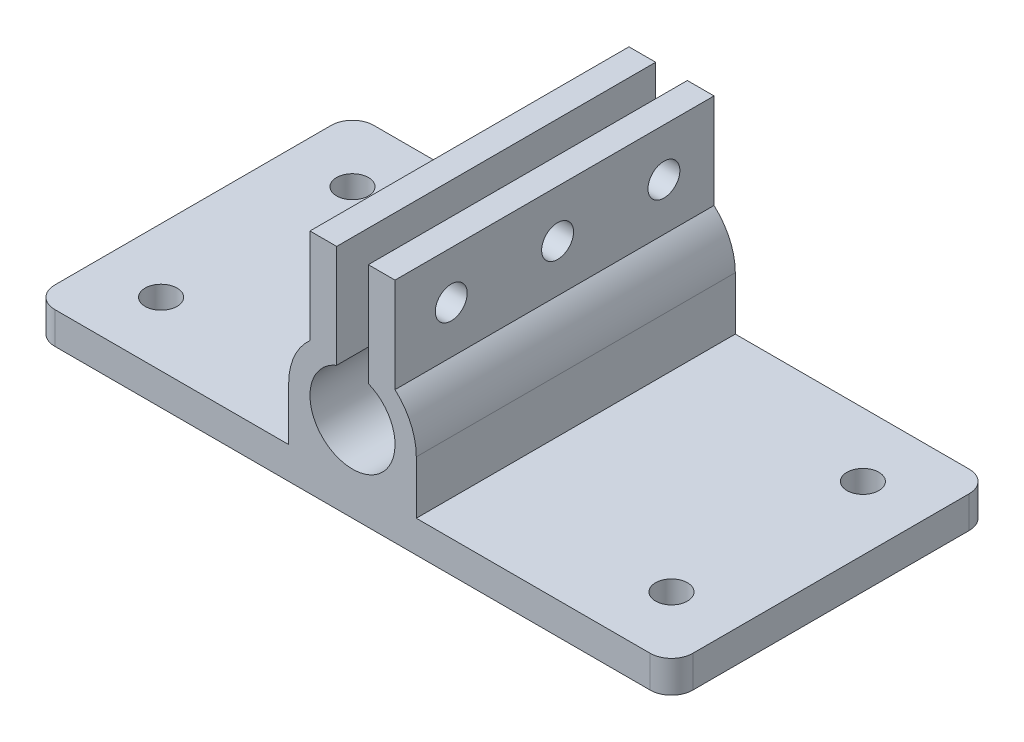
ISO-10303-21;
HEADER;
FILE_DESCRIPTION(('STEP AP214'),'2;1');
FILE_NAME('part.step','',(''),(''),'','','');
FILE_SCHEMA(('AUTOMOTIVE_DESIGN { 1 0 10303 214 1 1 1 1 }'));
ENDSEC;
DATA;
#1=APPLICATION_CONTEXT('core data for automotive mechanical design processes');
#2=APPLICATION_PROTOCOL_DEFINITION('international standard','automotive_design',2000,#1);
#3=PRODUCT_CONTEXT('',#1,'mechanical');
#4=PRODUCT('Part','Part','',(#3));
#5=PRODUCT_RELATED_PRODUCT_CATEGORY('part','',(#4));
#6=PRODUCT_DEFINITION_FORMATION('','',#4);
#7=PRODUCT_DEFINITION_CONTEXT('part definition',#1,'design');
#8=PRODUCT_DEFINITION('design','',#6,#7);
#9=PRODUCT_DEFINITION_SHAPE('','',#8);
#10=(LENGTH_UNIT() NAMED_UNIT(*) SI_UNIT(.MILLI.,.METRE.));
#11=(NAMED_UNIT(*) PLANE_ANGLE_UNIT() SI_UNIT($,.RADIAN.));
#12=(NAMED_UNIT(*) SI_UNIT($,.STERADIAN.) SOLID_ANGLE_UNIT());
#13=UNCERTAINTY_MEASURE_WITH_UNIT(LENGTH_MEASURE(1.E-05),#10,'distance_accuracy_value','');
#14=(GEOMETRIC_REPRESENTATION_CONTEXT(3) GLOBAL_UNCERTAINTY_ASSIGNED_CONTEXT((#13)) GLOBAL_UNIT_ASSIGNED_CONTEXT((#10,
#11,#12)) REPRESENTATION_CONTEXT('',''));
#15=CARTESIAN_POINT('',(0.,0.,0.));
#16=DIRECTION('',(0.,0.,1.));
#17=DIRECTION('',(1.,0.,0.));
#18=AXIS2_PLACEMENT_3D('',#15,#16,#17);
#19=CARTESIAN_POINT('',(-4.,21.3960387478949,-27.1575567721723));
#20=DIRECTION('',(0.,1.,0.));
#21=DIRECTION('',(0.,0.,1.));
#22=AXIS2_PLACEMENT_3D('',#19,#20,#21);
#23=PLANE('',#22);
#24=DIRECTION('',(0.,0.,-1.));
#25=VECTOR('',#24,1.);
#26=CARTESIAN_POINT('',(1.48842286881568,21.3960387478949,-27.1575567721723));
#27=LINE('',#26,#25);
#28=CARTESIAN_POINT('',(1.48842286881568,21.3960387478949,15.));
#29=VERTEX_POINT('',#28);
#30=CARTESIAN_POINT('',(1.48842286881568,21.3960387478949,-15.));
#31=VERTEX_POINT('',#30);
#32=EDGE_CURVE('E11',#29,#31,#27,.T.);
#33=ORIENTED_EDGE('',*,*,#32,.F.);
#34=DIRECTION('',(-1.,0.,0.));
#35=VECTOR('',#34,1.);
#36=CARTESIAN_POINT('',(-4.,21.3960387478949,15.));
#37=LINE('',#36,#35);
#38=CARTESIAN_POINT('',(4.,21.3960387478949,15.));
#39=VERTEX_POINT('',#38);
#40=EDGE_CURVE('E187',#39,#29,#37,.T.);
#41=ORIENTED_EDGE('',*,*,#40,.F.);
#42=DIRECTION('',(0.,0.,1.));
#43=VECTOR('',#42,1.);
#44=CARTESIAN_POINT('',(4.,21.3960387478949,-27.1575567721723));
#45=LINE('',#44,#43);
#46=CARTESIAN_POINT('',(4.,21.3960387478949,-15.));
#47=VERTEX_POINT('',#46);
#48=EDGE_CURVE('E363',#47,#39,#45,.T.);
#49=ORIENTED_EDGE('',*,*,#48,.F.);
#50=DIRECTION('',(1.,0.,0.));
#51=VECTOR('',#50,1.);
#52=CARTESIAN_POINT('',(-4.,21.3960387478949,-15.));
#53=LINE('',#52,#51);
#54=EDGE_CURVE('E356',#31,#47,#53,.T.);
#55=ORIENTED_EDGE('',*,*,#54,.F.);
#56=EDGE_LOOP('',(#33,#41,#49,#55));
#57=FACE_BOUND('',#56,.T.);
#58=ADVANCED_FACE('F33',(#57),#23,.T.);
#59=CARTESIAN_POINT('',(0.,8.,-31.9705627484771));
#60=DIRECTION('',(0.,0.,1.));
#61=DIRECTION('',(1.,0.,0.));
#62=AXIS2_PLACEMENT_3D('',#59,#60,#61);
#63=CYLINDRICAL_SURFACE('',#62,6.);
#64=DIRECTION('',(0.,0.,1.));
#65=VECTOR('',#64,1.);
#66=CARTESIAN_POINT('',(4.,12.4721359549996,-31.9705627484771));
#67=LINE('',#66,#65);
#68=CARTESIAN_POINT('',(4.,12.4721359549996,15.));
#69=VERTEX_POINT('',#68);
#70=CARTESIAN_POINT('',(4.,12.4721359549996,-15.));
#71=VERTEX_POINT('',#70);
#72=EDGE_CURVE('E194',#69,#71,#67,.F.);
#73=ORIENTED_EDGE('',*,*,#72,.F.);
#74=CARTESIAN_POINT('',(0.,8.,15.));
#75=DIRECTION('',(0.,0.,1.));
#76=DIRECTION('',(1.,0.,0.));
#77=AXIS2_PLACEMENT_3D('',#74,#75,#76);
#78=CIRCLE('',#77,6.);
#79=CARTESIAN_POINT('',(6.,8.,15.));
#80=VERTEX_POINT('',#79);
#81=EDGE_CURVE('E223',#80,#69,#78,.T.);
#82=ORIENTED_EDGE('',*,*,#81,.F.);
#83=DIRECTION('',(0.,0.,1.));
#84=VECTOR('',#83,1.);
#85=CARTESIAN_POINT('',(6.,8.,-28.));
#86=LINE('',#85,#84);
#87=CARTESIAN_POINT('',(6.,8.,-15.));
#88=VERTEX_POINT('',#87);
#89=EDGE_CURVE('E205',#88,#80,#86,.T.);
#90=ORIENTED_EDGE('',*,*,#89,.F.);
#91=CARTESIAN_POINT('',(0.,8.,-15.));
#92=DIRECTION('',(0.,0.,1.));
#93=DIRECTION('',(1.,0.,0.));
#94=AXIS2_PLACEMENT_3D('',#91,#92,#93);
#95=CIRCLE('',#94,6.);
#96=EDGE_CURVE('E226',#71,#88,#95,.F.);
#97=ORIENTED_EDGE('',*,*,#96,.F.);
#98=EDGE_LOOP('',(#73,#82,#90,#97));
#99=FACE_BOUND('',#98,.T.);
#100=ADVANCED_FACE('F435',(#99),#63,.T.);
#101=DIRECTION('',(0.,0.,1.));
#102=VECTOR('',#101,1.);
#103=CARTESIAN_POINT('',(-4.,12.4721359549996,-31.9705627484771));
#104=LINE('',#103,#102);
#105=CARTESIAN_POINT('',(-4.,12.4721359549996,-15.));
#106=VERTEX_POINT('',#105);
#107=CARTESIAN_POINT('',(-4.,12.4721359549996,15.));
#108=VERTEX_POINT('',#107);
#109=EDGE_CURVE('E199',#106,#108,#104,.T.);
#110=ORIENTED_EDGE('',*,*,#109,.F.);
#111=CARTESIAN_POINT('',(-6.,8.,-15.));
#112=VERTEX_POINT('',#111);
#113=EDGE_CURVE('E227',#112,#106,#95,.F.);
#114=ORIENTED_EDGE('',*,*,#113,.F.);
#115=DIRECTION('',(0.,0.,1.));
#116=VECTOR('',#115,1.);
#117=CARTESIAN_POINT('',(-6.,7.99999999999996,-28.));
#118=LINE('',#117,#116);
#119=CARTESIAN_POINT('',(-6.,7.99999999999996,15.));
#120=VERTEX_POINT('',#119);
#121=EDGE_CURVE('E211',#112,#120,#118,.T.);
#122=ORIENTED_EDGE('',*,*,#121,.T.);
#123=EDGE_CURVE('E222',#108,#120,#78,.T.);
#124=ORIENTED_EDGE('',*,*,#123,.F.);
#125=EDGE_LOOP('',(#110,#114,#122,#124));
#126=FACE_BOUND('',#125,.T.);
#127=ADVANCED_FACE('F381',(#126),#63,.T.);
#128=CARTESIAN_POINT('',(0.,3.,0.));
#129=DIRECTION('',(0.,-1.,0.));
#130=DIRECTION('',(0.,0.,-1.));
#131=AXIS2_PLACEMENT_3D('',#128,#129,#130);
#132=PLANE('',#131);
#133=CARTESIAN_POINT('',(24.,3.,-9.));
#134=DIRECTION('',(0.,1.,0.));
#135=DIRECTION('',(0.,0.,-1.));
#136=AXIS2_PLACEMENT_3D('',#133,#134,#135);
#137=CIRCLE('',#136,1.5);
#138=CARTESIAN_POINT('',(24.,3.,-10.5));
#139=VERTEX_POINT('',#138);
#140=EDGE_CURVE('E234',#139,#139,#137,.T.);
#141=ORIENTED_EDGE('',*,*,#140,.F.);
#142=EDGE_LOOP('',(#141));
#143=FACE_BOUND('',#142,.T.);
#144=CARTESIAN_POINT('',(24.,3.,9.));
#145=DIRECTION('',(0.,-1.,0.));
#146=DIRECTION('',(0.,0.,1.));
#147=AXIS2_PLACEMENT_3D('',#144,#145,#146);
#148=CIRCLE('',#147,1.5);
#149=CARTESIAN_POINT('',(24.,3.,10.5));
#150=VERTEX_POINT('',#149);
#151=EDGE_CURVE('E230',#150,#150,#148,.T.);
#152=ORIENTED_EDGE('',*,*,#151,.T.);
#153=EDGE_LOOP('',(#152));
#154=FACE_BOUND('',#153,.T.);
#155=DIRECTION('',(-1.,0.,0.));
#156=VECTOR('',#155,1.);
#157=CARTESIAN_POINT('',(30.,3.,-15.));
#158=LINE('',#157,#156);
#159=CARTESIAN_POINT('',(28.,3.,-15.));
#160=VERTEX_POINT('',#159);
#161=CARTESIAN_POINT('',(6.,3.,-15.));
#162=VERTEX_POINT('',#161);
#163=EDGE_CURVE('E267',#160,#162,#158,.T.);
#164=ORIENTED_EDGE('',*,*,#163,.T.);
#165=DIRECTION('',(0.,0.,1.));
#166=VECTOR('',#165,1.);
#167=CARTESIAN_POINT('',(6.,3.,-28.));
#168=LINE('',#167,#166);
#169=CARTESIAN_POINT('',(6.,3.,15.));
#170=VERTEX_POINT('',#169);
#171=EDGE_CURVE('E213',#162,#170,#168,.T.);
#172=ORIENTED_EDGE('',*,*,#171,.T.);
#173=DIRECTION('',(1.,0.,0.));
#174=VECTOR('',#173,1.);
#175=CARTESIAN_POINT('',(30.,3.,15.));
#176=LINE('',#175,#174);
#177=CARTESIAN_POINT('',(28.,3.,15.));
#178=VERTEX_POINT('',#177);
#179=EDGE_CURVE('E258',#170,#178,#176,.T.);
#180=ORIENTED_EDGE('',*,*,#179,.T.);
#181=CARTESIAN_POINT('',(28.,3.,13.));
#182=DIRECTION('',(0.,-1.,0.));
#183=DIRECTION('',(0.,0.,-1.));
#184=AXIS2_PLACEMENT_3D('',#181,#182,#183);
#185=CIRCLE('',#184,2.);
#186=CARTESIAN_POINT('',(30.,3.,13.));
#187=VERTEX_POINT('',#186);
#188=EDGE_CURVE('E301',#178,#187,#185,.F.);
#189=ORIENTED_EDGE('',*,*,#188,.T.);
#190=DIRECTION('',(0.,0.,-1.));
#191=VECTOR('',#190,1.);
#192=CARTESIAN_POINT('',(30.,3.,-15.));
#193=LINE('',#192,#191);
#194=CARTESIAN_POINT('',(30.,3.,-13.));
#195=VERTEX_POINT('',#194);
#196=EDGE_CURVE('E263',#187,#195,#193,.T.);
#197=ORIENTED_EDGE('',*,*,#196,.T.);
#198=CARTESIAN_POINT('',(28.,3.,-13.));
#199=DIRECTION('',(0.,-1.,0.));
#200=DIRECTION('',(0.,0.,-1.));
#201=AXIS2_PLACEMENT_3D('',#198,#199,#200);
#202=CIRCLE('',#201,2.);
#203=EDGE_CURVE('E303',#195,#160,#202,.F.);
#204=ORIENTED_EDGE('',*,*,#203,.T.);
#205=EDGE_LOOP('',(#164,#172,#180,#189,#197,#204));
#206=FACE_BOUND('',#205,.T.);
#207=ADVANCED_FACE('F426',(#143,#154,#206),#132,.F.);
#208=CARTESIAN_POINT('',(-30.,3.,-15.));
#209=DIRECTION('',(1.,0.,0.));
#210=DIRECTION('',(0.,0.,-1.));
#211=AXIS2_PLACEMENT_3D('',#208,#209,#210);
#212=PLANE('',#211);
#213=DIRECTION('',(0.,0.,1.));
#214=VECTOR('',#213,1.);
#215=CARTESIAN_POINT('',(-30.,3.,-15.));
#216=LINE('',#215,#214);
#217=CARTESIAN_POINT('',(-30.,3.,-13.));
#218=VERTEX_POINT('',#217);
#219=CARTESIAN_POINT('',(-30.,3.,13.));
#220=VERTEX_POINT('',#219);
#221=EDGE_CURVE('E255',#218,#220,#216,.T.);
#222=ORIENTED_EDGE('',*,*,#221,.F.);
#223=DIRECTION('',(0.,-1.,0.));
#224=VECTOR('',#223,1.);
#225=CARTESIAN_POINT('',(-30.,3.,-13.));
#226=LINE('',#225,#224);
#227=CARTESIAN_POINT('',(-30.,0.,-13.));
#228=VERTEX_POINT('',#227);
#229=EDGE_CURVE('E282',#218,#228,#226,.T.);
#230=ORIENTED_EDGE('',*,*,#229,.T.);
#231=DIRECTION('',(0.,0.,1.));
#232=VECTOR('',#231,1.);
#233=CARTESIAN_POINT('',(-30.,0.,-15.));
#234=LINE('',#233,#232);
#235=CARTESIAN_POINT('',(-30.,0.,13.));
#236=VERTEX_POINT('',#235);
#237=EDGE_CURVE('E252',#228,#236,#234,.T.);
#238=ORIENTED_EDGE('',*,*,#237,.T.);
#239=DIRECTION('',(0.,-1.,0.));
#240=VECTOR('',#239,1.);
#241=CARTESIAN_POINT('',(-30.,3.,13.));
#242=LINE('',#241,#240);
#243=EDGE_CURVE('E270',#236,#220,#242,.F.);
#244=ORIENTED_EDGE('',*,*,#243,.T.);
#245=EDGE_LOOP('',(#222,#230,#238,#244));
#246=FACE_BOUND('',#245,.T.);
#247=ADVANCED_FACE('F403',(#246),#212,.F.);
#248=CARTESIAN_POINT('',(30.,3.,15.));
#249=DIRECTION('',(0.,0.,-1.));
#250=DIRECTION('',(-1.,0.,0.));
#251=AXIS2_PLACEMENT_3D('',#248,#249,#250);
#252=PLANE('',#251);
#253=ORIENTED_EDGE('',*,*,#40,.T.);
#254=DIRECTION('',(0.,1.,0.));
#255=VECTOR('',#254,1.);
#256=CARTESIAN_POINT('',(1.48842286881568,22.8266163689609,15.));
#257=LINE('',#256,#255);
#258=CARTESIAN_POINT('',(1.48842286881568,11.7127614202351,15.));
#259=VERTEX_POINT('',#258);
#260=EDGE_CURVE('E49',#259,#29,#257,.T.);
#261=ORIENTED_EDGE('',*,*,#260,.F.);
#262=CARTESIAN_POINT('',(0.,8.,15.));
#263=DIRECTION('',(0.,0.,1.));
#264=DIRECTION('',(1.,0.,0.));
#265=AXIS2_PLACEMENT_3D('',#262,#263,#264);
#266=CIRCLE('',#265,4.);
#267=CARTESIAN_POINT('',(-1.48842286881568,11.7127614202351,15.));
#268=VERTEX_POINT('',#267);
#269=EDGE_CURVE('E185',#268,#259,#266,.T.);
#270=ORIENTED_EDGE('',*,*,#269,.F.);
#271=DIRECTION('',(0.,-1.,0.));
#272=VECTOR('',#271,1.);
#273=CARTESIAN_POINT('',(-1.48842286881568,22.8266163689609,15.));
#274=LINE('',#273,#272);
#275=CARTESIAN_POINT('',(-1.48842286881568,21.3960387478949,15.));
#276=VERTEX_POINT('',#275);
#277=EDGE_CURVE('E188',#276,#268,#274,.T.);
#278=ORIENTED_EDGE('',*,*,#277,.F.);
#279=CARTESIAN_POINT('',(-4.,21.3960387478949,15.));
#280=VERTEX_POINT('',#279);
#281=EDGE_CURVE('E358',#276,#280,#37,.T.);
#282=ORIENTED_EDGE('',*,*,#281,.T.);
#283=DIRECTION('',(0.,-1.,0.));
#284=VECTOR('',#283,1.);
#285=CARTESIAN_POINT('',(-4.,21.3960387478949,15.));
#286=LINE('',#285,#284);
#287=EDGE_CURVE('E360',#280,#108,#286,.T.);
#288=ORIENTED_EDGE('',*,*,#287,.T.);
#289=ORIENTED_EDGE('',*,*,#123,.T.);
#290=DIRECTION('',(0.,-1.,0.));
#291=VECTOR('',#290,1.);
#292=CARTESIAN_POINT('',(-6.,3.,15.));
#293=LINE('',#292,#291);
#294=CARTESIAN_POINT('',(-6.,3.,15.));
#295=VERTEX_POINT('',#294);
#296=EDGE_CURVE('E196',#120,#295,#293,.T.);
#297=ORIENTED_EDGE('',*,*,#296,.T.);
#298=CARTESIAN_POINT('',(-28.,3.,15.));
#299=VERTEX_POINT('',#298);
#300=EDGE_CURVE('E260',#299,#295,#176,.T.);
#301=ORIENTED_EDGE('',*,*,#300,.F.);
#302=DIRECTION('',(0.,-1.,0.));
#303=VECTOR('',#302,1.);
#304=CARTESIAN_POINT('',(-28.,3.,15.));
#305=LINE('',#304,#303);
#306=CARTESIAN_POINT('',(-28.,0.,15.));
#307=VERTEX_POINT('',#306);
#308=EDGE_CURVE('E312',#299,#307,#305,.T.);
#309=ORIENTED_EDGE('',*,*,#308,.T.);
#310=DIRECTION('',(1.,0.,0.));
#311=VECTOR('',#310,1.);
#312=CARTESIAN_POINT('',(30.,0.,15.));
#313=LINE('',#312,#311);
#314=CARTESIAN_POINT('',(28.,0.,15.));
#315=VERTEX_POINT('',#314);
#316=EDGE_CURVE('E273',#307,#315,#313,.T.);
#317=ORIENTED_EDGE('',*,*,#316,.T.);
#318=DIRECTION('',(0.,-1.,0.));
#319=VECTOR('',#318,1.);
#320=CARTESIAN_POINT('',(28.,3.,15.));
#321=LINE('',#320,#319);
#322=EDGE_CURVE('E315',#315,#178,#321,.F.);
#323=ORIENTED_EDGE('',*,*,#322,.T.);
#324=ORIENTED_EDGE('',*,*,#179,.F.);
#325=DIRECTION('',(0.,1.,0.));
#326=VECTOR('',#325,1.);
#327=CARTESIAN_POINT('',(6.,8.,15.));
#328=LINE('',#327,#326);
#329=EDGE_CURVE('E208',#170,#80,#328,.T.);
#330=ORIENTED_EDGE('',*,*,#329,.T.);
#331=ORIENTED_EDGE('',*,*,#81,.T.);
#332=DIRECTION('',(0.,1.,0.));
#333=VECTOR('',#332,1.);
#334=CARTESIAN_POINT('',(4.,21.3960387478949,15.));
#335=LINE('',#334,#333);
#336=EDGE_CURVE('E177',#69,#39,#335,.T.);
#337=ORIENTED_EDGE('',*,*,#336,.T.);
#338=EDGE_LOOP('',(#253,#261,#270,#278,#282,#288,#289,#297,#301,#309,#317,#323,#324,#330,#331,#337));
#339=FACE_BOUND('',#338,.T.);
#340=ADVANCED_FACE('F183',(#339),#252,.F.);
#341=CARTESIAN_POINT('',(30.,3.,-15.));
#342=DIRECTION('',(-1.,0.,0.));
#343=DIRECTION('',(0.,0.,1.));
#344=AXIS2_PLACEMENT_3D('',#341,#342,#343);
#345=PLANE('',#344);
#346=DIRECTION('',(0.,0.,-1.));
#347=VECTOR('',#346,1.);
#348=CARTESIAN_POINT('',(30.,0.,-15.));
#349=LINE('',#348,#347);
#350=CARTESIAN_POINT('',(30.,0.,13.));
#351=VERTEX_POINT('',#350);
#352=CARTESIAN_POINT('',(30.,0.,-13.));
#353=VERTEX_POINT('',#352);
#354=EDGE_CURVE('E276',#351,#353,#349,.T.);
#355=ORIENTED_EDGE('',*,*,#354,.T.);
#356=DIRECTION('',(0.,-1.,0.));
#357=VECTOR('',#356,1.);
#358=CARTESIAN_POINT('',(30.,3.,-13.));
#359=LINE('',#358,#357);
#360=EDGE_CURVE('E310',#353,#195,#359,.F.);
#361=ORIENTED_EDGE('',*,*,#360,.T.);
#362=ORIENTED_EDGE('',*,*,#196,.F.);
#363=DIRECTION('',(0.,-1.,0.));
#364=VECTOR('',#363,1.);
#365=CARTESIAN_POINT('',(30.,3.,13.));
#366=LINE('',#365,#364);
#367=EDGE_CURVE('E307',#187,#351,#366,.T.);
#368=ORIENTED_EDGE('',*,*,#367,.T.);
#369=EDGE_LOOP('',(#355,#361,#362,#368));
#370=FACE_BOUND('',#369,.T.);
#371=ADVANCED_FACE('F416',(#370),#345,.F.);
#372=CARTESIAN_POINT('',(30.,3.,-15.));
#373=DIRECTION('',(0.,0.,1.));
#374=DIRECTION('',(1.,0.,0.));
#375=AXIS2_PLACEMENT_3D('',#372,#373,#374);
#376=PLANE('',#375);
#377=CARTESIAN_POINT('',(0.,8.,-15.));
#378=DIRECTION('',(0.,0.,1.));
#379=DIRECTION('',(1.,0.,0.));
#380=AXIS2_PLACEMENT_3D('',#377,#378,#379);
#381=CIRCLE('',#380,4.);
#382=CARTESIAN_POINT('',(-1.48842286881568,11.7127614202351,-15.));
#383=VERTEX_POINT('',#382);
#384=CARTESIAN_POINT('',(1.48842286881568,11.7127614202351,-15.));
#385=VERTEX_POINT('',#384);
#386=EDGE_CURVE('E193',#383,#385,#381,.T.);
#387=ORIENTED_EDGE('',*,*,#386,.T.);
#388=DIRECTION('',(0.,1.,0.));
#389=VECTOR('',#388,1.);
#390=CARTESIAN_POINT('',(1.48842286881568,22.8266163689609,-15.));
#391=LINE('',#390,#389);
#392=EDGE_CURVE('E172',#385,#31,#391,.T.);
#393=ORIENTED_EDGE('',*,*,#392,.T.);
#394=ORIENTED_EDGE('',*,*,#54,.T.);
#395=DIRECTION('',(0.,-1.,0.));
#396=VECTOR('',#395,1.);
#397=CARTESIAN_POINT('',(4.,21.3960387478949,-15.));
#398=LINE('',#397,#396);
#399=EDGE_CURVE('E353',#47,#71,#398,.T.);
#400=ORIENTED_EDGE('',*,*,#399,.T.);
#401=ORIENTED_EDGE('',*,*,#96,.T.);
#402=DIRECTION('',(0.,-1.,0.));
#403=VECTOR('',#402,1.);
#404=CARTESIAN_POINT('',(6.,8.,-15.));
#405=LINE('',#404,#403);
#406=EDGE_CURVE('E202',#88,#162,#405,.T.);
#407=ORIENTED_EDGE('',*,*,#406,.T.);
#408=ORIENTED_EDGE('',*,*,#163,.F.);
#409=DIRECTION('',(0.,-1.,0.));
#410=VECTOR('',#409,1.);
#411=CARTESIAN_POINT('',(28.,3.,-15.));
#412=LINE('',#411,#410);
#413=CARTESIAN_POINT('',(28.,0.,-15.));
#414=VERTEX_POINT('',#413);
#415=EDGE_CURVE('E293',#160,#414,#412,.T.);
#416=ORIENTED_EDGE('',*,*,#415,.T.);
#417=DIRECTION('',(-1.,0.,0.));
#418=VECTOR('',#417,1.);
#419=CARTESIAN_POINT('',(30.,0.,-15.));
#420=LINE('',#419,#418);
#421=CARTESIAN_POINT('',(-28.,0.,-15.));
#422=VERTEX_POINT('',#421);
#423=EDGE_CURVE('E259',#414,#422,#420,.T.);
#424=ORIENTED_EDGE('',*,*,#423,.T.);
#425=DIRECTION('',(0.,-1.,0.));
#426=VECTOR('',#425,1.);
#427=CARTESIAN_POINT('',(-28.,3.,-15.));
#428=LINE('',#427,#426);
#429=CARTESIAN_POINT('',(-28.,3.,-15.));
#430=VERTEX_POINT('',#429);
#431=EDGE_CURVE('E296',#422,#430,#428,.F.);
#432=ORIENTED_EDGE('',*,*,#431,.T.);
#433=CARTESIAN_POINT('',(-6.,3.,-15.));
#434=VERTEX_POINT('',#433);
#435=EDGE_CURVE('E266',#434,#430,#158,.T.);
#436=ORIENTED_EDGE('',*,*,#435,.F.);
#437=DIRECTION('',(0.,1.,0.));
#438=VECTOR('',#437,1.);
#439=CARTESIAN_POINT('',(-6.,3.,-15.));
#440=LINE('',#439,#438);
#441=EDGE_CURVE('E204',#434,#112,#440,.T.);
#442=ORIENTED_EDGE('',*,*,#441,.T.);
#443=ORIENTED_EDGE('',*,*,#113,.T.);
#444=DIRECTION('',(0.,1.,0.));
#445=VECTOR('',#444,1.);
#446=CARTESIAN_POINT('',(-4.,21.3960387478949,-15.));
#447=LINE('',#446,#445);
#448=CARTESIAN_POINT('',(-4.,21.3960387478949,-15.));
#449=VERTEX_POINT('',#448);
#450=EDGE_CURVE('E351',#106,#449,#447,.T.);
#451=ORIENTED_EDGE('',*,*,#450,.T.);
#452=CARTESIAN_POINT('',(-1.48842286881568,21.3960387478949,-15.));
#453=VERTEX_POINT('',#452);
#454=EDGE_CURVE('E368',#449,#453,#53,.T.);
#455=ORIENTED_EDGE('',*,*,#454,.T.);
#456=DIRECTION('',(0.,-1.,0.));
#457=VECTOR('',#456,1.);
#458=CARTESIAN_POINT('',(-1.48842286881568,22.8266163689609,-15.));
#459=LINE('',#458,#457);
#460=EDGE_CURVE('E57',#453,#383,#459,.T.);
#461=ORIENTED_EDGE('',*,*,#460,.T.);
#462=EDGE_LOOP('',(#387,#393,#394,#400,#401,#407,#408,#416,#424,#432,#436,#442,#443,#451,#455,#461));
#463=FACE_BOUND('',#462,.T.);
#464=ADVANCED_FACE('F387',(#463),#376,.F.);
#465=CARTESIAN_POINT('',(-24.,3.,-9.));
#466=DIRECTION('',(0.,-1.,0.));
#467=DIRECTION('',(0.,0.,-1.));
#468=AXIS2_PLACEMENT_3D('',#465,#466,#467);
#469=CIRCLE('',#468,1.5);
#470=CARTESIAN_POINT('',(-24.,3.,-10.5));
#471=VERTEX_POINT('',#470);
#472=EDGE_CURVE('E240',#471,#471,#469,.T.);
#473=ORIENTED_EDGE('',*,*,#472,.T.);
#474=EDGE_LOOP('',(#473));
#475=FACE_BOUND('',#474,.T.);
#476=CARTESIAN_POINT('',(-24.,3.,9.));
#477=DIRECTION('',(0.,1.,0.));
#478=DIRECTION('',(0.,0.,1.));
#479=AXIS2_PLACEMENT_3D('',#476,#477,#478);
#480=CIRCLE('',#479,1.5);
#481=CARTESIAN_POINT('',(-24.,3.,10.5));
#482=VERTEX_POINT('',#481);
#483=EDGE_CURVE('E246',#482,#482,#480,.T.);
#484=ORIENTED_EDGE('',*,*,#483,.F.);
#485=EDGE_LOOP('',(#484));
#486=FACE_BOUND('',#485,.T.);
#487=ORIENTED_EDGE('',*,*,#300,.T.);
#488=DIRECTION('',(0.,0.,1.));
#489=VECTOR('',#488,1.);
#490=CARTESIAN_POINT('',(-6.,3.,-28.));
#491=LINE('',#490,#489);
#492=EDGE_CURVE('E216',#434,#295,#491,.T.);
#493=ORIENTED_EDGE('',*,*,#492,.F.);
#494=ORIENTED_EDGE('',*,*,#435,.T.);
#495=CARTESIAN_POINT('',(-28.,3.,-13.));
#496=DIRECTION('',(0.,-1.,0.));
#497=DIRECTION('',(0.,0.,-1.));
#498=AXIS2_PLACEMENT_3D('',#495,#496,#497);
#499=CIRCLE('',#498,2.);
#500=EDGE_CURVE('E305',#430,#218,#499,.F.);
#501=ORIENTED_EDGE('',*,*,#500,.T.);
#502=ORIENTED_EDGE('',*,*,#221,.T.);
#503=CARTESIAN_POINT('',(-28.,3.,13.));
#504=DIRECTION('',(0.,-1.,0.));
#505=DIRECTION('',(0.,0.,-1.));
#506=AXIS2_PLACEMENT_3D('',#503,#504,#505);
#507=CIRCLE('',#506,2.);
#508=EDGE_CURVE('E299',#220,#299,#507,.F.);
#509=ORIENTED_EDGE('',*,*,#508,.T.);
#510=EDGE_LOOP('',(#487,#493,#494,#501,#502,#509));
#511=FACE_BOUND('',#510,.T.);
#512=ADVANCED_FACE('F391',(#475,#486,#511),#132,.F.);
#513=CARTESIAN_POINT('',(0.,0.,0.));
#514=DIRECTION('',(0.,-1.,0.));
#515=DIRECTION('',(0.,0.,-1.));
#516=AXIS2_PLACEMENT_3D('',#513,#514,#515);
#517=PLANE('',#516);
#518=CARTESIAN_POINT('',(24.,0.,9.));
#519=DIRECTION('',(0.,-1.,0.));
#520=DIRECTION('',(0.,0.,1.));
#521=AXIS2_PLACEMENT_3D('',#518,#519,#520);
#522=CIRCLE('',#521,1.5);
#523=CARTESIAN_POINT('',(24.,0.,10.5));
#524=VERTEX_POINT('',#523);
#525=EDGE_CURVE('E231',#524,#524,#522,.T.);
#526=ORIENTED_EDGE('',*,*,#525,.F.);
#527=EDGE_LOOP('',(#526));
#528=FACE_BOUND('',#527,.T.);
#529=CARTESIAN_POINT('',(24.,0.,-9.));
#530=DIRECTION('',(0.,1.,0.));
#531=DIRECTION('',(0.,0.,-1.));
#532=AXIS2_PLACEMENT_3D('',#529,#530,#531);
#533=CIRCLE('',#532,1.5);
#534=CARTESIAN_POINT('',(24.,0.,-10.5));
#535=VERTEX_POINT('',#534);
#536=EDGE_CURVE('E237',#535,#535,#533,.T.);
#537=ORIENTED_EDGE('',*,*,#536,.T.);
#538=EDGE_LOOP('',(#537));
#539=FACE_BOUND('',#538,.T.);
#540=CARTESIAN_POINT('',(-24.,0.,-9.));
#541=DIRECTION('',(0.,-1.,0.));
#542=DIRECTION('',(0.,0.,-1.));
#543=AXIS2_PLACEMENT_3D('',#540,#541,#542);
#544=CIRCLE('',#543,1.5);
#545=CARTESIAN_POINT('',(-24.,0.,-10.5));
#546=VERTEX_POINT('',#545);
#547=EDGE_CURVE('E243',#546,#546,#544,.T.);
#548=ORIENTED_EDGE('',*,*,#547,.F.);
#549=EDGE_LOOP('',(#548));
#550=FACE_BOUND('',#549,.T.);
#551=CARTESIAN_POINT('',(-24.,0.,9.));
#552=DIRECTION('',(0.,1.,0.));
#553=DIRECTION('',(0.,0.,1.));
#554=AXIS2_PLACEMENT_3D('',#551,#552,#553);
#555=CIRCLE('',#554,1.5);
#556=CARTESIAN_POINT('',(-24.,0.,10.5));
#557=VERTEX_POINT('',#556);
#558=EDGE_CURVE('E249',#557,#557,#555,.T.);
#559=ORIENTED_EDGE('',*,*,#558,.T.);
#560=EDGE_LOOP('',(#559));
#561=FACE_BOUND('',#560,.T.);
#562=ORIENTED_EDGE('',*,*,#237,.F.);
#563=CARTESIAN_POINT('',(-28.,0.,-13.));
#564=DIRECTION('',(0.,-1.,0.));
#565=DIRECTION('',(0.,0.,-1.));
#566=AXIS2_PLACEMENT_3D('',#563,#564,#565);
#567=CIRCLE('',#566,2.);
#568=EDGE_CURVE('E291',#228,#422,#567,.T.);
#569=ORIENTED_EDGE('',*,*,#568,.T.);
#570=ORIENTED_EDGE('',*,*,#423,.F.);
#571=CARTESIAN_POINT('',(28.,0.,-13.));
#572=DIRECTION('',(0.,-1.,0.));
#573=DIRECTION('',(0.,0.,-1.));
#574=AXIS2_PLACEMENT_3D('',#571,#572,#573);
#575=CIRCLE('',#574,2.);
#576=EDGE_CURVE('E289',#414,#353,#575,.T.);
#577=ORIENTED_EDGE('',*,*,#576,.T.);
#578=ORIENTED_EDGE('',*,*,#354,.F.);
#579=CARTESIAN_POINT('',(28.,0.,13.));
#580=DIRECTION('',(0.,-1.,0.));
#581=DIRECTION('',(0.,0.,-1.));
#582=AXIS2_PLACEMENT_3D('',#579,#580,#581);
#583=CIRCLE('',#582,2.);
#584=EDGE_CURVE('E287',#351,#315,#583,.T.);
#585=ORIENTED_EDGE('',*,*,#584,.T.);
#586=ORIENTED_EDGE('',*,*,#316,.F.);
#587=CARTESIAN_POINT('',(-28.,0.,13.));
#588=DIRECTION('',(0.,-1.,0.));
#589=DIRECTION('',(0.,0.,-1.));
#590=AXIS2_PLACEMENT_3D('',#587,#588,#589);
#591=CIRCLE('',#590,2.);
#592=EDGE_CURVE('E285',#307,#236,#591,.T.);
#593=ORIENTED_EDGE('',*,*,#592,.T.);
#594=EDGE_LOOP('',(#562,#569,#570,#577,#578,#585,#586,#593));
#595=FACE_BOUND('',#594,.T.);
#596=ADVANCED_FACE('F401',(#528,#539,#550,#561,#595),#517,.T.);
#597=CARTESIAN_POINT('',(-24.,0.,9.));
#598=DIRECTION('',(0.,1.,0.));
#599=DIRECTION('',(0.,0.,1.));
#600=AXIS2_PLACEMENT_3D('',#597,#598,#599);
#601=CYLINDRICAL_SURFACE('',#600,1.5);
#602=ORIENTED_EDGE('',*,*,#558,.F.);
#603=EDGE_LOOP('',(#602));
#604=FACE_BOUND('',#603,.T.);
#605=ORIENTED_EDGE('',*,*,#483,.T.);
#606=EDGE_LOOP('',(#605));
#607=FACE_BOUND('',#606,.T.);
#608=ADVANCED_FACE('F487',(#604,#607),#601,.F.);
#609=CARTESIAN_POINT('',(-24.,0.,-9.));
#610=DIRECTION('',(0.,1.,0.));
#611=DIRECTION('',(0.,0.,1.));
#612=AXIS2_PLACEMENT_3D('',#609,#610,#611);
#613=CYLINDRICAL_SURFACE('',#612,1.5);
#614=ORIENTED_EDGE('',*,*,#547,.T.);
#615=EDGE_LOOP('',(#614));
#616=FACE_BOUND('',#615,.T.);
#617=ORIENTED_EDGE('',*,*,#472,.F.);
#618=EDGE_LOOP('',(#617));
#619=FACE_BOUND('',#618,.T.);
#620=ADVANCED_FACE('F483',(#616,#619),#613,.F.);
#621=CARTESIAN_POINT('',(24.,0.,-9.));
#622=DIRECTION('',(0.,1.,0.));
#623=DIRECTION('',(0.,0.,1.));
#624=AXIS2_PLACEMENT_3D('',#621,#622,#623);
#625=CYLINDRICAL_SURFACE('',#624,1.5);
#626=ORIENTED_EDGE('',*,*,#536,.F.);
#627=EDGE_LOOP('',(#626));
#628=FACE_BOUND('',#627,.T.);
#629=ORIENTED_EDGE('',*,*,#140,.T.);
#630=EDGE_LOOP('',(#629));
#631=FACE_BOUND('',#630,.T.);
#632=ADVANCED_FACE('F479',(#628,#631),#625,.F.);
#633=CARTESIAN_POINT('',(24.,0.,9.));
#634=DIRECTION('',(0.,1.,0.));
#635=DIRECTION('',(0.,0.,1.));
#636=AXIS2_PLACEMENT_3D('',#633,#634,#635);
#637=CYLINDRICAL_SURFACE('',#636,1.5);
#638=ORIENTED_EDGE('',*,*,#525,.T.);
#639=EDGE_LOOP('',(#638));
#640=FACE_BOUND('',#639,.T.);
#641=ORIENTED_EDGE('',*,*,#151,.F.);
#642=EDGE_LOOP('',(#641));
#643=FACE_BOUND('',#642,.T.);
#644=ADVANCED_FACE('F476',(#640,#643),#637,.F.);
#645=CARTESIAN_POINT('',(-28.,3.,-13.));
#646=DIRECTION('',(0.,-1.,0.));
#647=DIRECTION('',(0.,0.,-1.));
#648=AXIS2_PLACEMENT_3D('',#645,#646,#647);
#649=CYLINDRICAL_SURFACE('',#648,2.);
#650=ORIENTED_EDGE('',*,*,#500,.F.);
#651=ORIENTED_EDGE('',*,*,#431,.F.);
#652=ORIENTED_EDGE('',*,*,#568,.F.);
#653=ORIENTED_EDGE('',*,*,#229,.F.);
#654=EDGE_LOOP('',(#650,#651,#652,#653));
#655=FACE_BOUND('',#654,.T.);
#656=ADVANCED_FACE('F406',(#655),#649,.T.);
#657=CARTESIAN_POINT('',(28.,3.,-13.));
#658=DIRECTION('',(0.,-1.,0.));
#659=DIRECTION('',(0.,0.,-1.));
#660=AXIS2_PLACEMENT_3D('',#657,#658,#659);
#661=CYLINDRICAL_SURFACE('',#660,2.);
#662=ORIENTED_EDGE('',*,*,#203,.F.);
#663=ORIENTED_EDGE('',*,*,#360,.F.);
#664=ORIENTED_EDGE('',*,*,#576,.F.);
#665=ORIENTED_EDGE('',*,*,#415,.F.);
#666=EDGE_LOOP('',(#662,#663,#664,#665));
#667=FACE_BOUND('',#666,.T.);
#668=ADVANCED_FACE('F412',(#667),#661,.T.);
#669=CARTESIAN_POINT('',(28.,3.,13.));
#670=DIRECTION('',(0.,-1.,0.));
#671=DIRECTION('',(0.,0.,-1.));
#672=AXIS2_PLACEMENT_3D('',#669,#670,#671);
#673=CYLINDRICAL_SURFACE('',#672,2.);
#674=ORIENTED_EDGE('',*,*,#188,.F.);
#675=ORIENTED_EDGE('',*,*,#322,.F.);
#676=ORIENTED_EDGE('',*,*,#584,.F.);
#677=ORIENTED_EDGE('',*,*,#367,.F.);
#678=EDGE_LOOP('',(#674,#675,#676,#677));
#679=FACE_BOUND('',#678,.T.);
#680=ADVANCED_FACE('F421',(#679),#673,.T.);
#681=CARTESIAN_POINT('',(-28.,3.,13.));
#682=DIRECTION('',(0.,-1.,0.));
#683=DIRECTION('',(0.,0.,-1.));
#684=AXIS2_PLACEMENT_3D('',#681,#682,#683);
#685=CYLINDRICAL_SURFACE('',#684,2.);
#686=ORIENTED_EDGE('',*,*,#508,.F.);
#687=ORIENTED_EDGE('',*,*,#243,.F.);
#688=ORIENTED_EDGE('',*,*,#592,.F.);
#689=ORIENTED_EDGE('',*,*,#308,.F.);
#690=EDGE_LOOP('',(#686,#687,#688,#689));
#691=FACE_BOUND('',#690,.T.);
#692=ADVANCED_FACE('F35',(#691),#685,.T.);
#693=CARTESIAN_POINT('',(-6.,3.,-28.));
#694=DIRECTION('',(-1.,0.,0.));
#695=DIRECTION('',(0.,-1.,0.));
#696=AXIS2_PLACEMENT_3D('',#693,#694,#695);
#697=PLANE('',#696);
#698=ORIENTED_EDGE('',*,*,#441,.F.);
#699=ORIENTED_EDGE('',*,*,#492,.T.);
#700=ORIENTED_EDGE('',*,*,#296,.F.);
#701=ORIENTED_EDGE('',*,*,#121,.F.);
#702=EDGE_LOOP('',(#698,#699,#700,#701));
#703=FACE_BOUND('',#702,.T.);
#704=ADVANCED_FACE('F383',(#703),#697,.T.);
#705=CARTESIAN_POINT('',(6.,8.,-28.));
#706=DIRECTION('',(1.,0.,0.));
#707=DIRECTION('',(0.,0.,-1.));
#708=AXIS2_PLACEMENT_3D('',#705,#706,#707);
#709=PLANE('',#708);
#710=ORIENTED_EDGE('',*,*,#406,.F.);
#711=ORIENTED_EDGE('',*,*,#89,.T.);
#712=ORIENTED_EDGE('',*,*,#329,.F.);
#713=ORIENTED_EDGE('',*,*,#171,.F.);
#714=EDGE_LOOP('',(#710,#711,#712,#713));
#715=FACE_BOUND('',#714,.T.);
#716=ADVANCED_FACE('F430',(#715),#709,.T.);
#717=CARTESIAN_POINT('',(0.,8.,-15.));
#718=DIRECTION('',(0.,0.,1.));
#719=DIRECTION('',(1.,0.,0.));
#720=AXIS2_PLACEMENT_3D('',#717,#718,#719);
#721=CYLINDRICAL_SURFACE('',#720,4.);
#722=ORIENTED_EDGE('',*,*,#269,.T.);
#723=DIRECTION('',(0.,0.,1.));
#724=VECTOR('',#723,1.);
#725=CARTESIAN_POINT('',(1.48842286881568,11.7127614202351,-15.));
#726=LINE('',#725,#724);
#727=EDGE_CURVE('E169',#259,#385,#726,.F.);
#728=ORIENTED_EDGE('',*,*,#727,.T.);
#729=ORIENTED_EDGE('',*,*,#386,.F.);
#730=DIRECTION('',(0.,0.,1.));
#731=VECTOR('',#730,1.);
#732=CARTESIAN_POINT('',(-1.48842286881568,11.7127614202351,-15.));
#733=LINE('',#732,#731);
#734=EDGE_CURVE('E178',#383,#268,#733,.T.);
#735=ORIENTED_EDGE('',*,*,#734,.T.);
#736=EDGE_LOOP('',(#722,#728,#729,#735));
#737=FACE_BOUND('',#736,.T.);
#738=ADVANCED_FACE('F192',(#737),#721,.F.);
#739=CARTESIAN_POINT('',(4.,21.3960387478949,-27.1575567721723));
#740=DIRECTION('',(1.,0.,0.));
#741=DIRECTION('',(0.,1.,0.));
#742=AXIS2_PLACEMENT_3D('',#739,#740,#741);
#743=PLANE('',#742);
#744=CARTESIAN_POINT('',(4.,16.9340873514472,-10.286982430415));
#745=DIRECTION('',(1.,0.,0.));
#746=DIRECTION('',(0.,1.,0.));
#747=AXIS2_PLACEMENT_3D('',#744,#745,#746);
#748=CIRCLE('',#747,1.5);
#749=CARTESIAN_POINT('',(4.,18.4340873514472,-10.286982430415));
#750=VERTEX_POINT('',#749);
#751=EDGE_CURVE('E322',#750,#750,#748,.T.);
#752=ORIENTED_EDGE('',*,*,#751,.F.);
#753=EDGE_LOOP('',(#752));
#754=FACE_BOUND('',#753,.T.);
#755=CARTESIAN_POINT('',(4.,16.9340873514472,-0.286982430415037));
#756=DIRECTION('',(1.,0.,0.));
#757=DIRECTION('',(0.,1.,0.));
#758=AXIS2_PLACEMENT_3D('',#755,#756,#757);
#759=CIRCLE('',#758,1.5);
#760=CARTESIAN_POINT('',(4.,18.4340873514472,-0.286982430415037));
#761=VERTEX_POINT('',#760);
#762=EDGE_CURVE('E640',#761,#761,#759,.T.);
#763=ORIENTED_EDGE('',*,*,#762,.F.);
#764=EDGE_LOOP('',(#763));
#765=FACE_BOUND('',#764,.T.);
#766=CARTESIAN_POINT('',(4.,16.9340873514471,9.71301756958496));
#767=DIRECTION('',(1.,0.,0.));
#768=DIRECTION('',(0.,1.,0.));
#769=AXIS2_PLACEMENT_3D('',#766,#767,#768);
#770=CIRCLE('',#769,1.5);
#771=CARTESIAN_POINT('',(4.,18.4340873514471,9.71301756958496));
#772=VERTEX_POINT('',#771);
#773=EDGE_CURVE('E643',#772,#772,#770,.T.);
#774=ORIENTED_EDGE('',*,*,#773,.F.);
#775=EDGE_LOOP('',(#774));
#776=FACE_BOUND('',#775,.T.);
#777=ORIENTED_EDGE('',*,*,#336,.F.);
#778=ORIENTED_EDGE('',*,*,#72,.T.);
#779=ORIENTED_EDGE('',*,*,#399,.F.);
#780=ORIENTED_EDGE('',*,*,#48,.T.);
#781=EDGE_LOOP('',(#777,#778,#779,#780));
#782=FACE_BOUND('',#781,.T.);
#783=ADVANCED_FACE('F439',(#754,#765,#776,#782),#743,.T.);
#784=CARTESIAN_POINT('',(-4.,21.3960387478949,-27.1575567721723));
#785=DIRECTION('',(-1.,0.,0.));
#786=DIRECTION('',(0.,-1.,0.));
#787=AXIS2_PLACEMENT_3D('',#784,#785,#786);
#788=PLANE('',#787);
#789=CARTESIAN_POINT('',(-4.,16.9340873514472,-10.286982430415));
#790=DIRECTION('',(-1.,0.,0.));
#791=DIRECTION('',(0.,-1.,0.));
#792=AXIS2_PLACEMENT_3D('',#789,#790,#791);
#793=CIRCLE('',#792,1.5);
#794=CARTESIAN_POINT('',(-4.,15.4340873514472,-10.286982430415));
#795=VERTEX_POINT('',#794);
#796=EDGE_CURVE('E189',#795,#795,#793,.T.);
#797=ORIENTED_EDGE('',*,*,#796,.F.);
#798=EDGE_LOOP('',(#797));
#799=FACE_BOUND('',#798,.T.);
#800=CARTESIAN_POINT('',(-4.,16.9340873514471,-0.286982430415037));
#801=DIRECTION('',(-1.,0.,0.));
#802=DIRECTION('',(0.,-1.,0.));
#803=AXIS2_PLACEMENT_3D('',#800,#801,#802);
#804=CIRCLE('',#803,1.5);
#805=CARTESIAN_POINT('',(-4.,15.4340873514471,-0.286982430415037));
#806=VERTEX_POINT('',#805);
#807=EDGE_CURVE('E330',#806,#806,#804,.T.);
#808=ORIENTED_EDGE('',*,*,#807,.F.);
#809=EDGE_LOOP('',(#808));
#810=FACE_BOUND('',#809,.T.);
#811=CARTESIAN_POINT('',(-4.,16.9340873514471,9.71301756958496));
#812=DIRECTION('',(-1.,0.,0.));
#813=DIRECTION('',(0.,-1.,0.));
#814=AXIS2_PLACEMENT_3D('',#811,#812,#813);
#815=CIRCLE('',#814,1.5);
#816=CARTESIAN_POINT('',(-4.,15.4340873514471,9.71301756958496));
#817=VERTEX_POINT('',#816);
#818=EDGE_CURVE('E326',#817,#817,#815,.T.);
#819=ORIENTED_EDGE('',*,*,#818,.F.);
#820=EDGE_LOOP('',(#819));
#821=FACE_BOUND('',#820,.T.);
#822=ORIENTED_EDGE('',*,*,#450,.F.);
#823=ORIENTED_EDGE('',*,*,#109,.T.);
#824=ORIENTED_EDGE('',*,*,#287,.F.);
#825=DIRECTION('',(0.,0.,1.));
#826=VECTOR('',#825,1.);
#827=CARTESIAN_POINT('',(-4.,21.3960387478949,-27.1575567721723));
#828=LINE('',#827,#826);
#829=EDGE_CURVE('E354',#449,#280,#828,.T.);
#830=ORIENTED_EDGE('',*,*,#829,.F.);
#831=EDGE_LOOP('',(#822,#823,#824,#830));
#832=FACE_BOUND('',#831,.T.);
#833=ADVANCED_FACE('F374',(#799,#810,#821,#832),#788,.T.);
#834=DIRECTION('',(0.,0.,1.));
#835=VECTOR('',#834,1.);
#836=CARTESIAN_POINT('',(-1.48842286881568,21.3960387478949,-27.1575567721723));
#837=LINE('',#836,#835);
#838=EDGE_CURVE('E42',#453,#276,#837,.T.);
#839=ORIENTED_EDGE('',*,*,#838,.F.);
#840=ORIENTED_EDGE('',*,*,#454,.F.);
#841=ORIENTED_EDGE('',*,*,#829,.T.);
#842=ORIENTED_EDGE('',*,*,#281,.F.);
#843=EDGE_LOOP('',(#839,#840,#841,#842));
#844=FACE_BOUND('',#843,.T.);
#845=ADVANCED_FACE('F444',(#844),#23,.T.);
#846=CARTESIAN_POINT('',(-1.48842286881568,22.8266163689609,-15.));
#847=DIRECTION('',(-1.,0.,0.));
#848=DIRECTION('',(0.,0.,1.));
#849=AXIS2_PLACEMENT_3D('',#846,#847,#848);
#850=PLANE('',#849);
#851=CARTESIAN_POINT('',(-1.48842286881568,16.9340873514472,-10.286982430415));
#852=DIRECTION('',(-1.,0.,0.));
#853=DIRECTION('',(0.,0.,1.));
#854=AXIS2_PLACEMENT_3D('',#851,#852,#853);
#855=CIRCLE('',#854,1.5);
#856=CARTESIAN_POINT('',(-1.48842286881568,16.9340873514472,-8.78698243041504));
#857=VERTEX_POINT('',#856);
#858=EDGE_CURVE('E342',#857,#857,#855,.T.);
#859=ORIENTED_EDGE('',*,*,#858,.T.);
#860=EDGE_LOOP('',(#859));
#861=FACE_BOUND('',#860,.T.);
#862=CARTESIAN_POINT('',(-1.48842286881568,16.9340873514472,-0.286982430415037));
#863=DIRECTION('',(-1.,0.,0.));
#864=DIRECTION('',(0.,0.,1.));
#865=AXIS2_PLACEMENT_3D('',#862,#863,#864);
#866=CIRCLE('',#865,1.5);
#867=CARTESIAN_POINT('',(-1.48842286881568,16.9340873514472,1.21301756958496));
#868=VERTEX_POINT('',#867);
#869=EDGE_CURVE('E325',#868,#868,#866,.T.);
#870=ORIENTED_EDGE('',*,*,#869,.T.);
#871=EDGE_LOOP('',(#870));
#872=FACE_BOUND('',#871,.T.);
#873=CARTESIAN_POINT('',(-1.48842286881568,16.9340873514471,9.71301756958496));
#874=DIRECTION('',(-1.,0.,0.));
#875=DIRECTION('',(0.,0.,1.));
#876=AXIS2_PLACEMENT_3D('',#873,#874,#875);
#877=CIRCLE('',#876,1.5);
#878=CARTESIAN_POINT('',(-1.48842286881568,16.9340873514471,11.213017569585));
#879=VERTEX_POINT('',#878);
#880=EDGE_CURVE('E321',#879,#879,#877,.T.);
#881=ORIENTED_EDGE('',*,*,#880,.T.);
#882=EDGE_LOOP('',(#881));
#883=FACE_BOUND('',#882,.T.);
#884=ORIENTED_EDGE('',*,*,#460,.F.);
#885=ORIENTED_EDGE('',*,*,#838,.T.);
#886=ORIENTED_EDGE('',*,*,#277,.T.);
#887=ORIENTED_EDGE('',*,*,#734,.F.);
#888=EDGE_LOOP('',(#884,#885,#886,#887));
#889=FACE_BOUND('',#888,.T.);
#890=ADVANCED_FACE('F445',(#861,#872,#883,#889),#850,.F.);
#891=CARTESIAN_POINT('',(1.48842286881568,22.8266163689609,-15.));
#892=DIRECTION('',(1.,0.,0.));
#893=DIRECTION('',(0.,0.,-1.));
#894=AXIS2_PLACEMENT_3D('',#891,#892,#893);
#895=PLANE('',#894);
#896=CARTESIAN_POINT('',(1.48842286881568,16.9340873514472,-10.286982430415));
#897=DIRECTION('',(1.,0.,0.));
#898=DIRECTION('',(0.,0.,-1.));
#899=AXIS2_PLACEMENT_3D('',#896,#897,#898);
#900=CIRCLE('',#899,1.5);
#901=CARTESIAN_POINT('',(1.48842286881568,16.9340873514472,-11.786982430415));
#902=VERTEX_POINT('',#901);
#903=EDGE_CURVE('E37',#902,#902,#900,.T.);
#904=ORIENTED_EDGE('',*,*,#903,.T.);
#905=EDGE_LOOP('',(#904));
#906=FACE_BOUND('',#905,.T.);
#907=CARTESIAN_POINT('',(1.48842286881568,16.9340873514472,-0.286982430415037));
#908=DIRECTION('',(1.,0.,0.));
#909=DIRECTION('',(0.,0.,-1.));
#910=AXIS2_PLACEMENT_3D('',#907,#908,#909);
#911=CIRCLE('',#910,1.5);
#912=CARTESIAN_POINT('',(1.48842286881568,16.9340873514472,-1.78698243041504));
#913=VERTEX_POINT('',#912);
#914=EDGE_CURVE('E323',#913,#913,#911,.T.);
#915=ORIENTED_EDGE('',*,*,#914,.T.);
#916=EDGE_LOOP('',(#915));
#917=FACE_BOUND('',#916,.T.);
#918=CARTESIAN_POINT('',(1.48842286881568,16.9340873514471,9.71301756958496));
#919=DIRECTION('',(1.,0.,0.));
#920=DIRECTION('',(0.,0.,-1.));
#921=AXIS2_PLACEMENT_3D('',#918,#919,#920);
#922=CIRCLE('',#921,1.5);
#923=CARTESIAN_POINT('',(1.48842286881568,16.9340873514471,8.21301756958496));
#924=VERTEX_POINT('',#923);
#925=EDGE_CURVE('E319',#924,#924,#922,.T.);
#926=ORIENTED_EDGE('',*,*,#925,.T.);
#927=EDGE_LOOP('',(#926));
#928=FACE_BOUND('',#927,.T.);
#929=ORIENTED_EDGE('',*,*,#260,.T.);
#930=ORIENTED_EDGE('',*,*,#32,.T.);
#931=ORIENTED_EDGE('',*,*,#392,.F.);
#932=ORIENTED_EDGE('',*,*,#727,.F.);
#933=EDGE_LOOP('',(#929,#930,#931,#932));
#934=FACE_BOUND('',#933,.T.);
#935=ADVANCED_FACE('F170',(#906,#917,#928,#934),#895,.F.);
#936=CARTESIAN_POINT('',(-30.,16.9340873514471,9.71301756958496));
#937=DIRECTION('',(1.,0.,0.));
#938=DIRECTION('',(0.,1.,0.));
#939=AXIS2_PLACEMENT_3D('',#936,#937,#938);
#940=CYLINDRICAL_SURFACE('',#939,1.5);
#941=ORIENTED_EDGE('',*,*,#773,.T.);
#942=EDGE_LOOP('',(#941));
#943=FACE_BOUND('',#942,.T.);
#944=ORIENTED_EDGE('',*,*,#925,.F.);
#945=EDGE_LOOP('',(#944));
#946=FACE_BOUND('',#945,.T.);
#947=ADVANCED_FACE('F453',(#943,#946),#940,.F.);
#948=CARTESIAN_POINT('',(-30.,16.9340873514471,-0.286982430415037));
#949=DIRECTION('',(1.,0.,0.));
#950=DIRECTION('',(0.,1.,0.));
#951=AXIS2_PLACEMENT_3D('',#948,#949,#950);
#952=CYLINDRICAL_SURFACE('',#951,1.5);
#953=ORIENTED_EDGE('',*,*,#762,.T.);
#954=EDGE_LOOP('',(#953));
#955=FACE_BOUND('',#954,.T.);
#956=ORIENTED_EDGE('',*,*,#914,.F.);
#957=EDGE_LOOP('',(#956));
#958=FACE_BOUND('',#957,.T.);
#959=ADVANCED_FACE('F572',(#955,#958),#952,.F.);
#960=CARTESIAN_POINT('',(-30.,16.9340873514472,-10.286982430415));
#961=DIRECTION('',(1.,0.,0.));
#962=DIRECTION('',(0.,1.,0.));
#963=AXIS2_PLACEMENT_3D('',#960,#961,#962);
#964=CYLINDRICAL_SURFACE('',#963,1.5);
#965=ORIENTED_EDGE('',*,*,#751,.T.);
#966=EDGE_LOOP('',(#965));
#967=FACE_BOUND('',#966,.T.);
#968=ORIENTED_EDGE('',*,*,#903,.F.);
#969=EDGE_LOOP('',(#968));
#970=FACE_BOUND('',#969,.T.);
#971=ADVANCED_FACE('F581',(#967,#970),#964,.F.);
#972=ORIENTED_EDGE('',*,*,#818,.T.);
#973=EDGE_LOOP('',(#972));
#974=FACE_BOUND('',#973,.T.);
#975=ORIENTED_EDGE('',*,*,#880,.F.);
#976=EDGE_LOOP('',(#975));
#977=FACE_BOUND('',#976,.T.);
#978=ADVANCED_FACE('F574',(#974,#977),#940,.F.);
#979=ORIENTED_EDGE('',*,*,#807,.T.);
#980=EDGE_LOOP('',(#979));
#981=FACE_BOUND('',#980,.T.);
#982=ORIENTED_EDGE('',*,*,#869,.F.);
#983=EDGE_LOOP('',(#982));
#984=FACE_BOUND('',#983,.T.);
#985=ADVANCED_FACE('F584',(#981,#984),#952,.F.);
#986=ORIENTED_EDGE('',*,*,#796,.T.);
#987=EDGE_LOOP('',(#986));
#988=FACE_BOUND('',#987,.T.);
#989=ORIENTED_EDGE('',*,*,#858,.F.);
#990=EDGE_LOOP('',(#989));
#991=FACE_BOUND('',#990,.T.);
#992=ADVANCED_FACE('F593',(#988,#991),#964,.F.);
#993=CLOSED_SHELL('',(#58,#100,#127,#207,#247,#340,#371,#464,#512,#596,#608,#620,#632,#644,#656,
#668,#680,#692,#704,#716,#738,#783,#833,#845,#890,#935,#947,#959,#971,#978,#985,#992));
#994=MANIFOLD_SOLID_BREP('B2',#993);
#995=ADVANCED_BREP_SHAPE_REPRESENTATION('',(#18,#994),#14);
#996=SHAPE_DEFINITION_REPRESENTATION(#9,#995);
ENDSEC;
END-ISO-10303-21;
